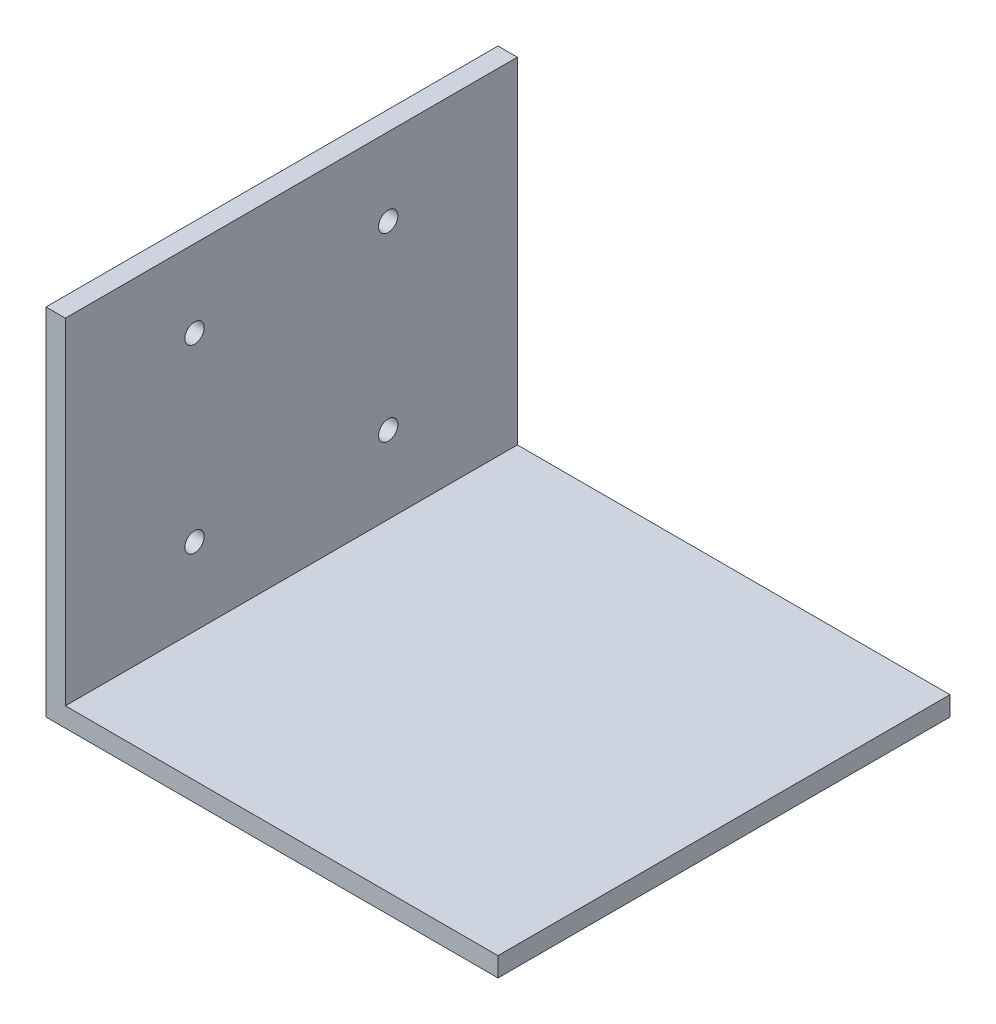
ISO-10303-21;
HEADER;
FILE_DESCRIPTION(('STEP AP214'),'2;1');
FILE_NAME('part.step','',(''),(''),'','','');
FILE_SCHEMA(('AUTOMOTIVE_DESIGN { 1 0 10303 214 1 1 1 1 }'));
ENDSEC;
DATA;
#1=APPLICATION_CONTEXT('core data for automotive mechanical design processes');
#2=APPLICATION_PROTOCOL_DEFINITION('international standard','automotive_design',2000,#1);
#3=PRODUCT_CONTEXT('',#1,'mechanical');
#4=PRODUCT('Part','Part','',(#3));
#5=PRODUCT_RELATED_PRODUCT_CATEGORY('part','',(#4));
#6=PRODUCT_DEFINITION_FORMATION('','',#4);
#7=PRODUCT_DEFINITION_CONTEXT('part definition',#1,'design');
#8=PRODUCT_DEFINITION('design','',#6,#7);
#9=PRODUCT_DEFINITION_SHAPE('','',#8);
#10=(LENGTH_UNIT() NAMED_UNIT(*) SI_UNIT(.MILLI.,.METRE.));
#11=(NAMED_UNIT(*) PLANE_ANGLE_UNIT() SI_UNIT($,.RADIAN.));
#12=(NAMED_UNIT(*) SI_UNIT($,.STERADIAN.) SOLID_ANGLE_UNIT());
#13=UNCERTAINTY_MEASURE_WITH_UNIT(LENGTH_MEASURE(1.E-05),#10,'distance_accuracy_value','');
#14=(GEOMETRIC_REPRESENTATION_CONTEXT(3) GLOBAL_UNCERTAINTY_ASSIGNED_CONTEXT((#13)) GLOBAL_UNIT_ASSIGNED_CONTEXT((#10,
#11,#12)) REPRESENTATION_CONTEXT('',''));
#15=CARTESIAN_POINT('',(0.,0.,0.));
#16=DIRECTION('',(0.,0.,1.));
#17=DIRECTION('',(1.,0.,0.));
#18=AXIS2_PLACEMENT_3D('',#15,#16,#17);
#19=CARTESIAN_POINT('',(70.,0.,70.));
#20=DIRECTION('',(0.,1.,0.));
#21=DIRECTION('',(-1.,0.,0.));
#22=AXIS2_PLACEMENT_3D('',#19,#20,#21);
#23=PLANE('',#22);
#24=DIRECTION('',(1.,0.,0.));
#25=VECTOR('',#24,1.);
#26=CARTESIAN_POINT('',(70.,0.,0.));
#27=LINE('',#26,#25);
#28=CARTESIAN_POINT('',(0.,0.,0.));
#29=VERTEX_POINT('',#28);
#30=CARTESIAN_POINT('',(70.,0.,0.));
#31=VERTEX_POINT('',#30);
#32=EDGE_CURVE('E125',#29,#31,#27,.T.);
#33=ORIENTED_EDGE('',*,*,#32,.T.);
#34=DIRECTION('',(0.,0.,-1.));
#35=VECTOR('',#34,1.);
#36=CARTESIAN_POINT('',(70.,0.,70.));
#37=LINE('',#36,#35);
#38=CARTESIAN_POINT('',(70.,0.,70.));
#39=VERTEX_POINT('',#38);
#40=EDGE_CURVE('E11',#39,#31,#37,.T.);
#41=ORIENTED_EDGE('',*,*,#40,.F.);
#42=DIRECTION('',(1.,0.,0.));
#43=VECTOR('',#42,1.);
#44=CARTESIAN_POINT('',(70.,0.,70.));
#45=LINE('',#44,#43);
#46=CARTESIAN_POINT('',(0.,0.,70.));
#47=VERTEX_POINT('',#46);
#48=EDGE_CURVE('E135',#47,#39,#45,.T.);
#49=ORIENTED_EDGE('',*,*,#48,.F.);
#50=DIRECTION('',(0.,0.,-1.));
#51=VECTOR('',#50,1.);
#52=CARTESIAN_POINT('',(0.,0.,70.));
#53=LINE('',#52,#51);
#54=EDGE_CURVE('E121',#47,#29,#53,.T.);
#55=ORIENTED_EDGE('',*,*,#54,.T.);
#56=EDGE_LOOP('',(#33,#41,#49,#55));
#57=FACE_BOUND('',#56,.T.);
#58=ADVANCED_FACE('F39',(#57),#23,.F.);
#59=CARTESIAN_POINT('',(70.,3.,70.));
#60=DIRECTION('',(-1.,0.,0.));
#61=DIRECTION('',(0.,0.,1.));
#62=AXIS2_PLACEMENT_3D('',#59,#60,#61);
#63=PLANE('',#62);
#64=DIRECTION('',(0.,1.,0.));
#65=VECTOR('',#64,1.);
#66=CARTESIAN_POINT('',(70.,3.,0.));
#67=LINE('',#66,#65);
#68=CARTESIAN_POINT('',(70.,3.,0.));
#69=VERTEX_POINT('',#68);
#70=EDGE_CURVE('E128',#31,#69,#67,.T.);
#71=ORIENTED_EDGE('',*,*,#70,.T.);
#72=DIRECTION('',(0.,0.,-1.));
#73=VECTOR('',#72,1.);
#74=CARTESIAN_POINT('',(70.,3.,70.));
#75=LINE('',#74,#73);
#76=CARTESIAN_POINT('',(70.,3.,70.));
#77=VERTEX_POINT('',#76);
#78=EDGE_CURVE('E48',#77,#69,#75,.T.);
#79=ORIENTED_EDGE('',*,*,#78,.F.);
#80=DIRECTION('',(0.,1.,0.));
#81=VECTOR('',#80,1.);
#82=CARTESIAN_POINT('',(70.,3.,70.));
#83=LINE('',#82,#81);
#84=EDGE_CURVE('E94',#39,#77,#83,.T.);
#85=ORIENTED_EDGE('',*,*,#84,.F.);
#86=ORIENTED_EDGE('',*,*,#40,.T.);
#87=EDGE_LOOP('',(#71,#79,#85,#86));
#88=FACE_BOUND('',#87,.T.);
#89=ADVANCED_FACE('F170',(#88),#63,.F.);
#90=CARTESIAN_POINT('',(3.,3.,70.));
#91=DIRECTION('',(0.,-1.,0.));
#92=DIRECTION('',(1.,0.,0.));
#93=AXIS2_PLACEMENT_3D('',#90,#91,#92);
#94=PLANE('',#93);
#95=DIRECTION('',(-1.,0.,0.));
#96=VECTOR('',#95,1.);
#97=CARTESIAN_POINT('',(3.,3.,0.));
#98=LINE('',#97,#96);
#99=CARTESIAN_POINT('',(3.,3.,0.));
#100=VERTEX_POINT('',#99);
#101=EDGE_CURVE('E130',#69,#100,#98,.T.);
#102=ORIENTED_EDGE('',*,*,#101,.T.);
#103=DIRECTION('',(0.,0.,-1.));
#104=VECTOR('',#103,1.);
#105=CARTESIAN_POINT('',(3.,3.,70.));
#106=LINE('',#105,#104);
#107=CARTESIAN_POINT('',(3.,3.,70.));
#108=VERTEX_POINT('',#107);
#109=EDGE_CURVE('E116',#108,#100,#106,.T.);
#110=ORIENTED_EDGE('',*,*,#109,.F.);
#111=DIRECTION('',(-1.,0.,0.));
#112=VECTOR('',#111,1.);
#113=CARTESIAN_POINT('',(3.,3.,70.));
#114=LINE('',#113,#112);
#115=EDGE_CURVE('E107',#77,#108,#114,.T.);
#116=ORIENTED_EDGE('',*,*,#115,.F.);
#117=ORIENTED_EDGE('',*,*,#78,.T.);
#118=EDGE_LOOP('',(#102,#110,#116,#117));
#119=FACE_BOUND('',#118,.T.);
#120=ADVANCED_FACE('F175',(#119),#94,.F.);
#121=CARTESIAN_POINT('',(3.,55.,70.));
#122=DIRECTION('',(-1.,0.,0.));
#123=DIRECTION('',(0.,-1.,0.));
#124=AXIS2_PLACEMENT_3D('',#121,#122,#123);
#125=PLANE('',#124);
#126=CARTESIAN_POINT('',(3.,15.,50.));
#127=DIRECTION('',(1.,0.,0.));
#128=DIRECTION('',(0.,-1.,0.));
#129=AXIS2_PLACEMENT_3D('',#126,#127,#128);
#130=CIRCLE('',#129,1.5);
#131=CARTESIAN_POINT('',(3.,13.5,50.));
#132=VERTEX_POINT('',#131);
#133=EDGE_CURVE('E189',#132,#132,#130,.T.);
#134=ORIENTED_EDGE('',*,*,#133,.F.);
#135=EDGE_LOOP('',(#134));
#136=FACE_BOUND('',#135,.T.);
#137=CARTESIAN_POINT('',(3.,15.,20.));
#138=DIRECTION('',(1.,0.,0.));
#139=DIRECTION('',(0.,1.,0.));
#140=AXIS2_PLACEMENT_3D('',#137,#138,#139);
#141=CIRCLE('',#140,1.5);
#142=CARTESIAN_POINT('',(3.,16.5,20.));
#143=VERTEX_POINT('',#142);
#144=EDGE_CURVE('E191',#143,#143,#141,.T.);
#145=ORIENTED_EDGE('',*,*,#144,.F.);
#146=EDGE_LOOP('',(#145));
#147=FACE_BOUND('',#146,.T.);
#148=CARTESIAN_POINT('',(3.,43.,20.));
#149=DIRECTION('',(1.,0.,0.));
#150=DIRECTION('',(0.,-1.,0.));
#151=AXIS2_PLACEMENT_3D('',#148,#149,#150);
#152=CIRCLE('',#151,1.5);
#153=CARTESIAN_POINT('',(3.,41.5,20.));
#154=VERTEX_POINT('',#153);
#155=EDGE_CURVE('E188',#154,#154,#152,.T.);
#156=ORIENTED_EDGE('',*,*,#155,.F.);
#157=EDGE_LOOP('',(#156));
#158=FACE_BOUND('',#157,.T.);
#159=CARTESIAN_POINT('',(3.,43.,50.));
#160=DIRECTION('',(1.,0.,0.));
#161=DIRECTION('',(0.,1.,0.));
#162=AXIS2_PLACEMENT_3D('',#159,#160,#161);
#163=CIRCLE('',#162,1.5);
#164=CARTESIAN_POINT('',(3.,44.5,50.));
#165=VERTEX_POINT('',#164);
#166=EDGE_CURVE('E145',#165,#165,#163,.T.);
#167=ORIENTED_EDGE('',*,*,#166,.F.);
#168=EDGE_LOOP('',(#167));
#169=FACE_BOUND('',#168,.T.);
#170=DIRECTION('',(0.,1.,0.));
#171=VECTOR('',#170,1.);
#172=CARTESIAN_POINT('',(3.,55.,0.));
#173=LINE('',#172,#171);
#174=CARTESIAN_POINT('',(3.,55.,0.));
#175=VERTEX_POINT('',#174);
#176=EDGE_CURVE('E115',#100,#175,#173,.T.);
#177=ORIENTED_EDGE('',*,*,#176,.T.);
#178=DIRECTION('',(0.,0.,-1.));
#179=VECTOR('',#178,1.);
#180=CARTESIAN_POINT('',(3.,55.,70.));
#181=LINE('',#180,#179);
#182=CARTESIAN_POINT('',(3.,55.,70.));
#183=VERTEX_POINT('',#182);
#184=EDGE_CURVE('E112',#183,#175,#181,.T.);
#185=ORIENTED_EDGE('',*,*,#184,.F.);
#186=DIRECTION('',(0.,1.,0.));
#187=VECTOR('',#186,1.);
#188=CARTESIAN_POINT('',(3.,55.,70.));
#189=LINE('',#188,#187);
#190=EDGE_CURVE('E101',#108,#183,#189,.T.);
#191=ORIENTED_EDGE('',*,*,#190,.F.);
#192=ORIENTED_EDGE('',*,*,#109,.T.);
#193=EDGE_LOOP('',(#177,#185,#191,#192));
#194=FACE_BOUND('',#193,.T.);
#195=ADVANCED_FACE('F113',(#136,#147,#158,#169,#194),#125,.F.);
#196=CARTESIAN_POINT('',(0.,55.,70.));
#197=DIRECTION('',(0.,-1.,0.));
#198=DIRECTION('',(0.,0.,-1.));
#199=AXIS2_PLACEMENT_3D('',#196,#197,#198);
#200=PLANE('',#199);
#201=DIRECTION('',(-1.,0.,0.));
#202=VECTOR('',#201,1.);
#203=CARTESIAN_POINT('',(0.,55.,0.));
#204=LINE('',#203,#202);
#205=CARTESIAN_POINT('',(0.,55.,0.));
#206=VERTEX_POINT('',#205);
#207=EDGE_CURVE('E80',#175,#206,#204,.T.);
#208=ORIENTED_EDGE('',*,*,#207,.T.);
#209=DIRECTION('',(0.,0.,-1.));
#210=VECTOR('',#209,1.);
#211=CARTESIAN_POINT('',(0.,55.,70.));
#212=LINE('',#211,#210);
#213=CARTESIAN_POINT('',(0.,55.,70.));
#214=VERTEX_POINT('',#213);
#215=EDGE_CURVE('E117',#214,#206,#212,.T.);
#216=ORIENTED_EDGE('',*,*,#215,.F.);
#217=DIRECTION('',(-1.,0.,0.));
#218=VECTOR('',#217,1.);
#219=CARTESIAN_POINT('',(0.,55.,70.));
#220=LINE('',#219,#218);
#221=EDGE_CURVE('E105',#183,#214,#220,.T.);
#222=ORIENTED_EDGE('',*,*,#221,.F.);
#223=ORIENTED_EDGE('',*,*,#184,.T.);
#224=EDGE_LOOP('',(#208,#216,#222,#223));
#225=FACE_BOUND('',#224,.T.);
#226=ADVANCED_FACE('F119',(#225),#200,.F.);
#227=CARTESIAN_POINT('',(0.,0.,70.));
#228=DIRECTION('',(1.,0.,0.));
#229=DIRECTION('',(0.,0.,-1.));
#230=AXIS2_PLACEMENT_3D('',#227,#228,#229);
#231=PLANE('',#230);
#232=CARTESIAN_POINT('',(0.,15.,50.));
#233=DIRECTION('',(1.,0.,0.));
#234=DIRECTION('',(0.,0.,-1.));
#235=AXIS2_PLACEMENT_3D('',#232,#233,#234);
#236=CIRCLE('',#235,1.5);
#237=CARTESIAN_POINT('',(0.,15.,48.5));
#238=VERTEX_POINT('',#237);
#239=EDGE_CURVE('E42',#238,#238,#236,.T.);
#240=ORIENTED_EDGE('',*,*,#239,.T.);
#241=EDGE_LOOP('',(#240));
#242=FACE_BOUND('',#241,.T.);
#243=CARTESIAN_POINT('',(0.,15.,20.));
#244=DIRECTION('',(1.,0.,0.));
#245=DIRECTION('',(0.,0.,-1.));
#246=AXIS2_PLACEMENT_3D('',#243,#244,#245);
#247=CIRCLE('',#246,1.5);
#248=CARTESIAN_POINT('',(0.,15.,18.5));
#249=VERTEX_POINT('',#248);
#250=EDGE_CURVE('E147',#249,#249,#247,.T.);
#251=ORIENTED_EDGE('',*,*,#250,.T.);
#252=EDGE_LOOP('',(#251));
#253=FACE_BOUND('',#252,.T.);
#254=CARTESIAN_POINT('',(0.,43.,20.));
#255=DIRECTION('',(1.,0.,0.));
#256=DIRECTION('',(0.,0.,-1.));
#257=AXIS2_PLACEMENT_3D('',#254,#255,#256);
#258=CIRCLE('',#257,1.5);
#259=CARTESIAN_POINT('',(0.,43.,18.5));
#260=VERTEX_POINT('',#259);
#261=EDGE_CURVE('E144',#260,#260,#258,.T.);
#262=ORIENTED_EDGE('',*,*,#261,.T.);
#263=EDGE_LOOP('',(#262));
#264=FACE_BOUND('',#263,.T.);
#265=CARTESIAN_POINT('',(0.,43.,50.));
#266=DIRECTION('',(1.,0.,0.));
#267=DIRECTION('',(0.,0.,-1.));
#268=AXIS2_PLACEMENT_3D('',#265,#266,#267);
#269=CIRCLE('',#268,1.5);
#270=CARTESIAN_POINT('',(0.,43.,48.5));
#271=VERTEX_POINT('',#270);
#272=EDGE_CURVE('E141',#271,#271,#269,.T.);
#273=ORIENTED_EDGE('',*,*,#272,.T.);
#274=EDGE_LOOP('',(#273));
#275=FACE_BOUND('',#274,.T.);
#276=DIRECTION('',(0.,-1.,0.));
#277=VECTOR('',#276,1.);
#278=CARTESIAN_POINT('',(0.,0.,0.));
#279=LINE('',#278,#277);
#280=EDGE_CURVE('E86',#206,#29,#279,.T.);
#281=ORIENTED_EDGE('',*,*,#280,.T.);
#282=ORIENTED_EDGE('',*,*,#54,.F.);
#283=DIRECTION('',(0.,-1.,0.));
#284=VECTOR('',#283,1.);
#285=CARTESIAN_POINT('',(0.,0.,70.));
#286=LINE('',#285,#284);
#287=EDGE_CURVE('E57',#214,#47,#286,.T.);
#288=ORIENTED_EDGE('',*,*,#287,.F.);
#289=ORIENTED_EDGE('',*,*,#215,.T.);
#290=EDGE_LOOP('',(#281,#282,#288,#289));
#291=FACE_BOUND('',#290,.T.);
#292=ADVANCED_FACE('F154',(#242,#253,#264,#275,#291),#231,.F.);
#293=CARTESIAN_POINT('',(0.,0.,70.));
#294=DIRECTION('',(0.,0.,-1.));
#295=DIRECTION('',(-1.,0.,0.));
#296=AXIS2_PLACEMENT_3D('',#293,#294,#295);
#297=PLANE('',#296);
#298=ORIENTED_EDGE('',*,*,#48,.T.);
#299=ORIENTED_EDGE('',*,*,#84,.T.);
#300=ORIENTED_EDGE('',*,*,#115,.T.);
#301=ORIENTED_EDGE('',*,*,#190,.T.);
#302=ORIENTED_EDGE('',*,*,#221,.T.);
#303=ORIENTED_EDGE('',*,*,#287,.T.);
#304=EDGE_LOOP('',(#298,#299,#300,#301,#302,#303));
#305=FACE_BOUND('',#304,.T.);
#306=ADVANCED_FACE('F103',(#305),#297,.F.);
#307=CARTESIAN_POINT('',(0.,0.,0.));
#308=DIRECTION('',(0.,0.,-1.));
#309=DIRECTION('',(-1.,0.,0.));
#310=AXIS2_PLACEMENT_3D('',#307,#308,#309);
#311=PLANE('',#310);
#312=ORIENTED_EDGE('',*,*,#32,.F.);
#313=ORIENTED_EDGE('',*,*,#280,.F.);
#314=ORIENTED_EDGE('',*,*,#207,.F.);
#315=ORIENTED_EDGE('',*,*,#176,.F.);
#316=ORIENTED_EDGE('',*,*,#101,.F.);
#317=ORIENTED_EDGE('',*,*,#70,.F.);
#318=EDGE_LOOP('',(#312,#313,#314,#315,#316,#317));
#319=FACE_BOUND('',#318,.T.);
#320=ADVANCED_FACE('F180',(#319),#311,.T.);
#321=CARTESIAN_POINT('',(-67.,43.,50.));
#322=DIRECTION('',(1.,0.,0.));
#323=DIRECTION('',(0.,1.,0.));
#324=AXIS2_PLACEMENT_3D('',#321,#322,#323);
#325=CYLINDRICAL_SURFACE('',#324,1.5);
#326=ORIENTED_EDGE('',*,*,#166,.T.);
#327=EDGE_LOOP('',(#326));
#328=FACE_BOUND('',#327,.T.);
#329=ORIENTED_EDGE('',*,*,#272,.F.);
#330=EDGE_LOOP('',(#329));
#331=FACE_BOUND('',#330,.T.);
#332=ADVANCED_FACE('F205',(#328,#331),#325,.F.);
#333=CARTESIAN_POINT('',(-67.,43.,20.));
#334=DIRECTION('',(1.,0.,0.));
#335=DIRECTION('',(0.,1.,0.));
#336=AXIS2_PLACEMENT_3D('',#333,#334,#335);
#337=CYLINDRICAL_SURFACE('',#336,1.5);
#338=ORIENTED_EDGE('',*,*,#155,.T.);
#339=EDGE_LOOP('',(#338));
#340=FACE_BOUND('',#339,.T.);
#341=ORIENTED_EDGE('',*,*,#261,.F.);
#342=EDGE_LOOP('',(#341));
#343=FACE_BOUND('',#342,.T.);
#344=ADVANCED_FACE('F164',(#340,#343),#337,.F.);
#345=CARTESIAN_POINT('',(-67.,15.,20.));
#346=DIRECTION('',(1.,0.,0.));
#347=DIRECTION('',(0.,1.,0.));
#348=AXIS2_PLACEMENT_3D('',#345,#346,#347);
#349=CYLINDRICAL_SURFACE('',#348,1.5);
#350=ORIENTED_EDGE('',*,*,#144,.T.);
#351=EDGE_LOOP('',(#350));
#352=FACE_BOUND('',#351,.T.);
#353=ORIENTED_EDGE('',*,*,#250,.F.);
#354=EDGE_LOOP('',(#353));
#355=FACE_BOUND('',#354,.T.);
#356=ADVANCED_FACE('F158',(#352,#355),#349,.F.);
#357=CARTESIAN_POINT('',(-67.,15.,50.));
#358=DIRECTION('',(1.,0.,0.));
#359=DIRECTION('',(0.,1.,0.));
#360=AXIS2_PLACEMENT_3D('',#357,#358,#359);
#361=CYLINDRICAL_SURFACE('',#360,1.5);
#362=ORIENTED_EDGE('',*,*,#133,.T.);
#363=EDGE_LOOP('',(#362));
#364=FACE_BOUND('',#363,.T.);
#365=ORIENTED_EDGE('',*,*,#239,.F.);
#366=EDGE_LOOP('',(#365));
#367=FACE_BOUND('',#366,.T.);
#368=ADVANCED_FACE('F156',(#364,#367),#361,.F.);
#369=CLOSED_SHELL('',(#58,#89,#120,#195,#226,#292,#306,#320,#332,#344,#356,#368));
#370=MANIFOLD_SOLID_BREP('B2',#369);
#371=ADVANCED_BREP_SHAPE_REPRESENTATION('',(#18,#370),#14);
#372=SHAPE_DEFINITION_REPRESENTATION(#9,#371);
ENDSEC;
END-ISO-10303-21;
